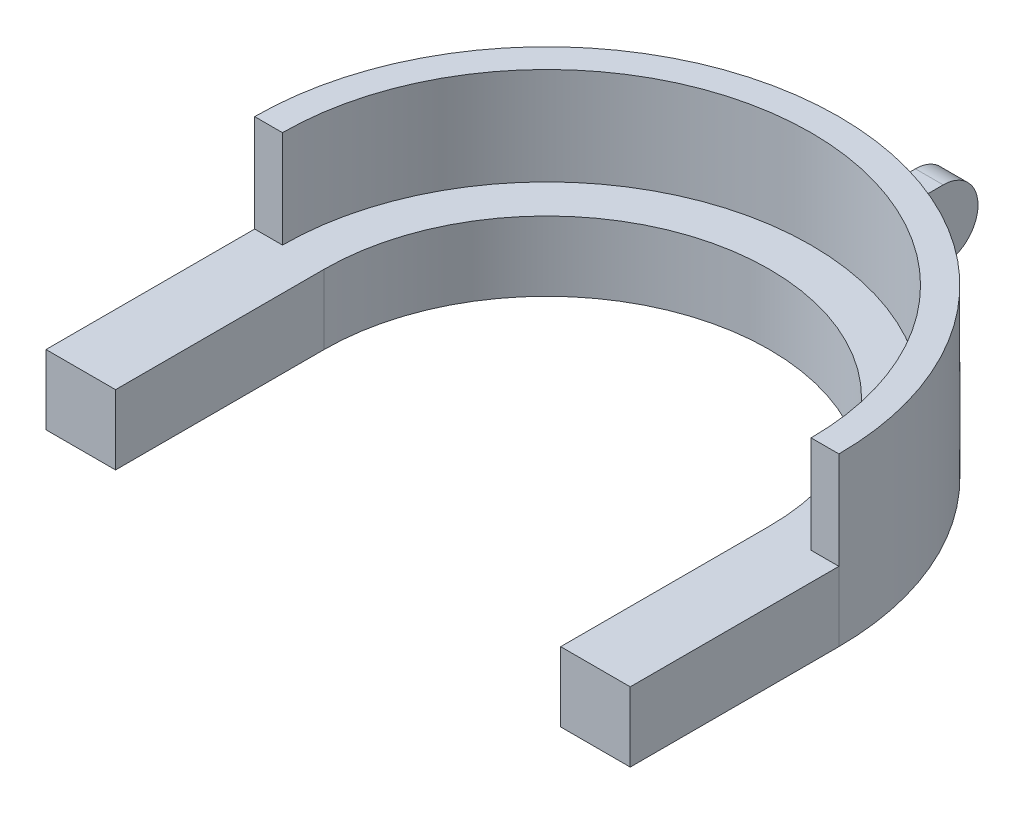
ISO-10303-21;
HEADER;
FILE_DESCRIPTION(('STEP AP214'),'2;1');
FILE_NAME('part.step','',(''),(''),'','','');
FILE_SCHEMA(('AUTOMOTIVE_DESIGN { 1 0 10303 214 1 1 1 1 }'));
ENDSEC;
DATA;
#1=APPLICATION_CONTEXT('core data for automotive mechanical design processes');
#2=APPLICATION_PROTOCOL_DEFINITION('international standard','automotive_design',2000,#1);
#3=PRODUCT_CONTEXT('',#1,'mechanical');
#4=PRODUCT('Part','Part','',(#3));
#5=PRODUCT_RELATED_PRODUCT_CATEGORY('part','',(#4));
#6=PRODUCT_DEFINITION_FORMATION('','',#4);
#7=PRODUCT_DEFINITION_CONTEXT('part definition',#1,'design');
#8=PRODUCT_DEFINITION('design','',#6,#7);
#9=PRODUCT_DEFINITION_SHAPE('','',#8);
#10=(LENGTH_UNIT() NAMED_UNIT(*) SI_UNIT(.MILLI.,.METRE.));
#11=(NAMED_UNIT(*) PLANE_ANGLE_UNIT() SI_UNIT($,.RADIAN.));
#12=(NAMED_UNIT(*) SI_UNIT($,.STERADIAN.) SOLID_ANGLE_UNIT());
#13=UNCERTAINTY_MEASURE_WITH_UNIT(LENGTH_MEASURE(1.E-05),#10,'distance_accuracy_value','');
#14=(GEOMETRIC_REPRESENTATION_CONTEXT(3) GLOBAL_UNCERTAINTY_ASSIGNED_CONTEXT((#13)) GLOBAL_UNIT_ASSIGNED_CONTEXT((#10,
#11,#12)) REPRESENTATION_CONTEXT('',''));
#15=CARTESIAN_POINT('',(0.,0.,0.));
#16=DIRECTION('',(0.,0.,1.));
#17=DIRECTION('',(1.,0.,0.));
#18=AXIS2_PLACEMENT_3D('',#15,#16,#17);
#19=CARTESIAN_POINT('',(0.,24.,0.));
#20=DIRECTION('',(0.,-1.,0.));
#21=DIRECTION('',(0.,0.,-1.));
#22=AXIS2_PLACEMENT_3D('',#19,#20,#21);
#23=CYLINDRICAL_SURFACE('',#22,42.);
#24=CARTESIAN_POINT('',(0.,0.,0.));
#25=DIRECTION('',(0.,-1.,0.));
#26=DIRECTION('',(0.,0.,-1.));
#27=AXIS2_PLACEMENT_3D('',#24,#25,#26);
#28=CIRCLE('',#27,42.);
#29=CARTESIAN_POINT('',(2.00000000000001,0.,-41.9523539268061));
#30=VERTEX_POINT('',#29);
#31=CARTESIAN_POINT('',(42.,0.,0.));
#32=VERTEX_POINT('',#31);
#33=EDGE_CURVE('E214',#30,#32,#28,.T.);
#34=ORIENTED_EDGE('',*,*,#33,.F.);
#35=DIRECTION('',(0.,-1.,0.));
#36=VECTOR('',#35,1.);
#37=CARTESIAN_POINT('',(2.00000000000001,24.,-41.9523539268061));
#38=LINE('',#37,#36);
#39=CARTESIAN_POINT('',(2.00000000000001,10.,-41.9523539268061));
#40=VERTEX_POINT('',#39);
#41=EDGE_CURVE('E46',#30,#40,#38,.F.);
#42=ORIENTED_EDGE('',*,*,#41,.T.);
#43=CARTESIAN_POINT('',(0.,10.,0.));
#44=DIRECTION('',(0.,1.,0.));
#45=DIRECTION('',(0.,0.,1.));
#46=AXIS2_PLACEMENT_3D('',#43,#44,#45);
#47=CIRCLE('',#46,42.);
#48=CARTESIAN_POINT('',(-1.99999999999999,10.,-41.9523539268061));
#49=VERTEX_POINT('',#48);
#50=EDGE_CURVE('E257',#49,#40,#47,.F.);
#51=ORIENTED_EDGE('',*,*,#50,.F.);
#52=DIRECTION('',(0.,-1.,0.));
#53=VECTOR('',#52,1.);
#54=CARTESIAN_POINT('',(-1.99999999999999,24.,-41.9523539268061));
#55=LINE('',#54,#53);
#56=CARTESIAN_POINT('',(-1.99999999999999,0.,-41.9523539268061));
#57=VERTEX_POINT('',#56);
#58=EDGE_CURVE('E259',#57,#49,#55,.F.);
#59=ORIENTED_EDGE('',*,*,#58,.F.);
#60=CARTESIAN_POINT('',(-42.,0.,0.));
#61=VERTEX_POINT('',#60);
#62=EDGE_CURVE('E159',#61,#57,#28,.T.);
#63=ORIENTED_EDGE('',*,*,#62,.F.);
#64=DIRECTION('',(0.,-1.,0.));
#65=VECTOR('',#64,1.);
#66=CARTESIAN_POINT('',(-42.,10.,0.));
#67=LINE('',#66,#65);
#68=CARTESIAN_POINT('',(-42.,10.,0.));
#69=VERTEX_POINT('',#68);
#70=EDGE_CURVE('E215',#69,#61,#67,.T.);
#71=ORIENTED_EDGE('',*,*,#70,.F.);
#72=DIRECTION('',(0.,-1.,0.));
#73=VECTOR('',#72,1.);
#74=CARTESIAN_POINT('',(-42.,24.,0.));
#75=LINE('',#74,#73);
#76=CARTESIAN_POINT('',(-42.,24.,0.));
#77=VERTEX_POINT('',#76);
#78=EDGE_CURVE('E241',#77,#69,#75,.T.);
#79=ORIENTED_EDGE('',*,*,#78,.F.);
#80=CARTESIAN_POINT('',(0.,24.,0.));
#81=DIRECTION('',(0.,-1.,0.));
#82=DIRECTION('',(0.,0.,-1.));
#83=AXIS2_PLACEMENT_3D('',#80,#81,#82);
#84=CIRCLE('',#83,42.);
#85=CARTESIAN_POINT('',(42.,24.,0.));
#86=VERTEX_POINT('',#85);
#87=EDGE_CURVE('E226',#77,#86,#84,.T.);
#88=ORIENTED_EDGE('',*,*,#87,.T.);
#89=DIRECTION('',(0.,-1.,0.));
#90=VECTOR('',#89,1.);
#91=CARTESIAN_POINT('',(42.,24.,0.));
#92=LINE('',#91,#90);
#93=CARTESIAN_POINT('',(42.,10.,0.));
#94=VERTEX_POINT('',#93);
#95=EDGE_CURVE('E238',#86,#94,#92,.T.);
#96=ORIENTED_EDGE('',*,*,#95,.T.);
#97=DIRECTION('',(0.,-1.,0.));
#98=VECTOR('',#97,1.);
#99=CARTESIAN_POINT('',(42.,10.,0.));
#100=LINE('',#99,#98);
#101=EDGE_CURVE('E173',#94,#32,#100,.T.);
#102=ORIENTED_EDGE('',*,*,#101,.T.);
#103=EDGE_LOOP('',(#34,#42,#51,#59,#63,#71,#79,#88,#96,#102));
#104=FACE_BOUND('',#103,.T.);
#105=ADVANCED_FACE('F38',(#104),#23,.T.);
#106=CARTESIAN_POINT('',(32.,10.,0.));
#107=DIRECTION('',(0.,0.,-1.));
#108=DIRECTION('',(-1.,0.,0.));
#109=AXIS2_PLACEMENT_3D('',#106,#107,#108);
#110=PLANE('',#109);
#111=DIRECTION('',(-1.,0.,0.));
#112=VECTOR('',#111,1.);
#113=CARTESIAN_POINT('',(0.,10.,0.));
#114=LINE('',#113,#112);
#115=CARTESIAN_POINT('',(38.,10.,0.));
#116=VERTEX_POINT('',#115);
#117=EDGE_CURVE('E189',#94,#116,#114,.T.);
#118=ORIENTED_EDGE('',*,*,#117,.F.);
#119=ORIENTED_EDGE('',*,*,#95,.F.);
#120=DIRECTION('',(-1.,0.,0.));
#121=VECTOR('',#120,1.);
#122=CARTESIAN_POINT('',(38.,24.,0.));
#123=LINE('',#122,#121);
#124=CARTESIAN_POINT('',(38.,24.,0.));
#125=VERTEX_POINT('',#124);
#126=EDGE_CURVE('E229',#86,#125,#123,.T.);
#127=ORIENTED_EDGE('',*,*,#126,.T.);
#128=DIRECTION('',(0.,-1.,0.));
#129=VECTOR('',#128,1.);
#130=CARTESIAN_POINT('',(38.,24.,0.));
#131=LINE('',#130,#129);
#132=EDGE_CURVE('E234',#125,#116,#131,.T.);
#133=ORIENTED_EDGE('',*,*,#132,.T.);
#134=EDGE_LOOP('',(#118,#119,#127,#133));
#135=FACE_BOUND('',#134,.T.);
#136=ADVANCED_FACE('F279',(#135),#110,.F.);
#137=CARTESIAN_POINT('',(-38.,10.,0.));
#138=DIRECTION('',(0.,0.,-1.));
#139=DIRECTION('',(-1.,0.,0.));
#140=AXIS2_PLACEMENT_3D('',#137,#138,#139);
#141=PLANE('',#140);
#142=DIRECTION('',(-1.,0.,0.));
#143=VECTOR('',#142,1.);
#144=CARTESIAN_POINT('',(0.,10.,0.));
#145=LINE('',#144,#143);
#146=CARTESIAN_POINT('',(-38.,10.,0.));
#147=VERTEX_POINT('',#146);
#148=EDGE_CURVE('E199',#147,#69,#145,.T.);
#149=ORIENTED_EDGE('',*,*,#148,.F.);
#150=DIRECTION('',(0.,-1.,0.));
#151=VECTOR('',#150,1.);
#152=CARTESIAN_POINT('',(-38.,24.,-2.65352581752078E-13));
#153=LINE('',#152,#151);
#154=CARTESIAN_POINT('',(-38.,24.,-2.65352581752078E-13));
#155=VERTEX_POINT('',#154);
#156=EDGE_CURVE('E232',#155,#147,#153,.T.);
#157=ORIENTED_EDGE('',*,*,#156,.F.);
#158=DIRECTION('',(-1.,0.,0.));
#159=VECTOR('',#158,1.);
#160=CARTESIAN_POINT('',(-38.,24.,-2.65352581752078E-13));
#161=LINE('',#160,#159);
#162=EDGE_CURVE('E223',#155,#77,#161,.T.);
#163=ORIENTED_EDGE('',*,*,#162,.T.);
#164=ORIENTED_EDGE('',*,*,#78,.T.);
#165=EDGE_LOOP('',(#149,#157,#163,#164));
#166=FACE_BOUND('',#165,.T.);
#167=ADVANCED_FACE('F40',(#166),#141,.F.);
#168=CARTESIAN_POINT('',(0.,10.,0.));
#169=DIRECTION('',(0.,-1.,0.));
#170=DIRECTION('',(0.,0.,-1.));
#171=AXIS2_PLACEMENT_3D('',#168,#169,#170);
#172=CYLINDRICAL_SURFACE('',#171,32.);
#173=CARTESIAN_POINT('',(0.,0.,0.));
#174=DIRECTION('',(0.,-1.,0.));
#175=DIRECTION('',(0.,0.,1.));
#176=AXIS2_PLACEMENT_3D('',#173,#174,#175);
#177=CIRCLE('',#176,32.);
#178=CARTESIAN_POINT('',(-32.,0.,0.));
#179=VERTEX_POINT('',#178);
#180=CARTESIAN_POINT('',(32.,0.,0.));
#181=VERTEX_POINT('',#180);
#182=EDGE_CURVE('E237',#179,#181,#177,.T.);
#183=ORIENTED_EDGE('',*,*,#182,.T.);
#184=DIRECTION('',(0.,-1.,0.));
#185=VECTOR('',#184,1.);
#186=CARTESIAN_POINT('',(32.,10.,0.));
#187=LINE('',#186,#185);
#188=CARTESIAN_POINT('',(32.,10.,0.));
#189=VERTEX_POINT('',#188);
#190=EDGE_CURVE('E251',#189,#181,#187,.T.);
#191=ORIENTED_EDGE('',*,*,#190,.F.);
#192=CARTESIAN_POINT('',(0.,10.,0.));
#193=DIRECTION('',(0.,-1.,0.));
#194=DIRECTION('',(0.,0.,1.));
#195=AXIS2_PLACEMENT_3D('',#192,#193,#194);
#196=CIRCLE('',#195,32.);
#197=CARTESIAN_POINT('',(-32.,10.,0.));
#198=VERTEX_POINT('',#197);
#199=EDGE_CURVE('E248',#198,#189,#196,.T.);
#200=ORIENTED_EDGE('',*,*,#199,.F.);
#201=DIRECTION('',(0.,-1.,0.));
#202=VECTOR('',#201,1.);
#203=CARTESIAN_POINT('',(-32.,10.,0.));
#204=LINE('',#203,#202);
#205=EDGE_CURVE('E255',#198,#179,#204,.T.);
#206=ORIENTED_EDGE('',*,*,#205,.T.);
#207=EDGE_LOOP('',(#183,#191,#200,#206));
#208=FACE_BOUND('',#207,.T.);
#209=ADVANCED_FACE('F297',(#208),#172,.F.);
#210=CARTESIAN_POINT('',(0.,10.,0.));
#211=DIRECTION('',(0.,1.,0.));
#212=DIRECTION('',(0.,0.,1.));
#213=AXIS2_PLACEMENT_3D('',#210,#211,#212);
#214=PLANE('',#213);
#215=CARTESIAN_POINT('',(0.,10.,0.));
#216=DIRECTION('',(0.,1.,0.));
#217=DIRECTION('',(0.,0.,1.));
#218=AXIS2_PLACEMENT_3D('',#215,#216,#217);
#219=CIRCLE('',#218,38.);
#220=EDGE_CURVE('E246',#116,#147,#219,.T.);
#221=ORIENTED_EDGE('',*,*,#220,.T.);
#222=ORIENTED_EDGE('',*,*,#148,.T.);
#223=DIRECTION('',(0.,0.,1.));
#224=VECTOR('',#223,1.);
#225=CARTESIAN_POINT('',(-42.,10.,0.));
#226=LINE('',#225,#224);
#227=CARTESIAN_POINT('',(-42.,10.,30.));
#228=VERTEX_POINT('',#227);
#229=EDGE_CURVE('E196',#69,#228,#226,.T.);
#230=ORIENTED_EDGE('',*,*,#229,.T.);
#231=DIRECTION('',(1.,0.,0.));
#232=VECTOR('',#231,1.);
#233=CARTESIAN_POINT('',(0.,10.,30.));
#234=LINE('',#233,#232);
#235=CARTESIAN_POINT('',(-32.,10.,30.));
#236=VERTEX_POINT('',#235);
#237=EDGE_CURVE('E194',#228,#236,#234,.T.);
#238=ORIENTED_EDGE('',*,*,#237,.T.);
#239=DIRECTION('',(0.,0.,1.));
#240=VECTOR('',#239,1.);
#241=CARTESIAN_POINT('',(-32.,10.,0.));
#242=LINE('',#241,#240);
#243=EDGE_CURVE('E202',#198,#236,#242,.T.);
#244=ORIENTED_EDGE('',*,*,#243,.F.);
#245=ORIENTED_EDGE('',*,*,#199,.T.);
#246=DIRECTION('',(0.,0.,1.));
#247=VECTOR('',#246,1.);
#248=CARTESIAN_POINT('',(32.,10.,0.));
#249=LINE('',#248,#247);
#250=CARTESIAN_POINT('',(32.,10.,30.));
#251=VERTEX_POINT('',#250);
#252=EDGE_CURVE('E191',#189,#251,#249,.T.);
#253=ORIENTED_EDGE('',*,*,#252,.T.);
#254=DIRECTION('',(1.,0.,0.));
#255=VECTOR('',#254,1.);
#256=CARTESIAN_POINT('',(0.,10.,30.));
#257=LINE('',#256,#255);
#258=CARTESIAN_POINT('',(42.,10.,30.));
#259=VERTEX_POINT('',#258);
#260=EDGE_CURVE('E181',#251,#259,#257,.T.);
#261=ORIENTED_EDGE('',*,*,#260,.T.);
#262=DIRECTION('',(0.,0.,1.));
#263=VECTOR('',#262,1.);
#264=CARTESIAN_POINT('',(42.,10.,0.));
#265=LINE('',#264,#263);
#266=EDGE_CURVE('E172',#94,#259,#265,.T.);
#267=ORIENTED_EDGE('',*,*,#266,.F.);
#268=ORIENTED_EDGE('',*,*,#117,.T.);
#269=EDGE_LOOP('',(#221,#222,#230,#238,#244,#245,#253,#261,#267,#268));
#270=FACE_BOUND('',#269,.T.);
#271=ADVANCED_FACE('F294',(#270),#214,.T.);
#272=CARTESIAN_POINT('',(0.,0.,0.));
#273=DIRECTION('',(0.,1.,0.));
#274=DIRECTION('',(0.,0.,1.));
#275=AXIS2_PLACEMENT_3D('',#272,#273,#274);
#276=PLANE('',#275);
#277=DIRECTION('',(0.,0.,-1.));
#278=VECTOR('',#277,1.);
#279=CARTESIAN_POINT('',(-1.99999999999999,0.,-36.));
#280=LINE('',#279,#278);
#281=CARTESIAN_POINT('',(-1.99999999999999,0.,-55.));
#282=VERTEX_POINT('',#281);
#283=EDGE_CURVE('E151',#57,#282,#280,.T.);
#284=ORIENTED_EDGE('',*,*,#283,.T.);
#285=DIRECTION('',(-1.,0.,0.));
#286=VECTOR('',#285,1.);
#287=CARTESIAN_POINT('',(8.00000000000001,0.,-55.));
#288=LINE('',#287,#286);
#289=CARTESIAN_POINT('',(2.00000000000001,0.,-55.));
#290=VERTEX_POINT('',#289);
#291=EDGE_CURVE('E143',#290,#282,#288,.T.);
#292=ORIENTED_EDGE('',*,*,#291,.F.);
#293=DIRECTION('',(0.,0.,-1.));
#294=VECTOR('',#293,1.);
#295=CARTESIAN_POINT('',(2.00000000000001,0.,-36.));
#296=LINE('',#295,#294);
#297=EDGE_CURVE('E60',#30,#290,#296,.T.);
#298=ORIENTED_EDGE('',*,*,#297,.F.);
#299=ORIENTED_EDGE('',*,*,#33,.T.);
#300=DIRECTION('',(0.,0.,1.));
#301=VECTOR('',#300,1.);
#302=CARTESIAN_POINT('',(42.,0.,0.));
#303=LINE('',#302,#301);
#304=CARTESIAN_POINT('',(42.,0.,30.));
#305=VERTEX_POINT('',#304);
#306=EDGE_CURVE('E177',#32,#305,#303,.T.);
#307=ORIENTED_EDGE('',*,*,#306,.T.);
#308=DIRECTION('',(1.,0.,0.));
#309=VECTOR('',#308,1.);
#310=CARTESIAN_POINT('',(0.,0.,30.));
#311=LINE('',#310,#309);
#312=CARTESIAN_POINT('',(32.,0.,30.));
#313=VERTEX_POINT('',#312);
#314=EDGE_CURVE('E183',#313,#305,#311,.T.);
#315=ORIENTED_EDGE('',*,*,#314,.F.);
#316=DIRECTION('',(0.,0.,1.));
#317=VECTOR('',#316,1.);
#318=CARTESIAN_POINT('',(32.,0.,0.));
#319=LINE('',#318,#317);
#320=EDGE_CURVE('E180',#181,#313,#319,.T.);
#321=ORIENTED_EDGE('',*,*,#320,.F.);
#322=ORIENTED_EDGE('',*,*,#182,.F.);
#323=DIRECTION('',(0.,0.,1.));
#324=VECTOR('',#323,1.);
#325=CARTESIAN_POINT('',(-32.,0.,0.));
#326=LINE('',#325,#324);
#327=CARTESIAN_POINT('',(-32.,0.,30.));
#328=VERTEX_POINT('',#327);
#329=EDGE_CURVE('E197',#179,#328,#326,.T.);
#330=ORIENTED_EDGE('',*,*,#329,.T.);
#331=DIRECTION('',(1.,0.,0.));
#332=VECTOR('',#331,1.);
#333=CARTESIAN_POINT('',(0.,0.,30.));
#334=LINE('',#333,#332);
#335=CARTESIAN_POINT('',(-42.,0.,30.));
#336=VERTEX_POINT('',#335);
#337=EDGE_CURVE('E186',#336,#328,#334,.T.);
#338=ORIENTED_EDGE('',*,*,#337,.F.);
#339=DIRECTION('',(0.,0.,1.));
#340=VECTOR('',#339,1.);
#341=CARTESIAN_POINT('',(-42.,0.,0.));
#342=LINE('',#341,#340);
#343=EDGE_CURVE('E208',#61,#336,#342,.T.);
#344=ORIENTED_EDGE('',*,*,#343,.F.);
#345=ORIENTED_EDGE('',*,*,#62,.T.);
#346=EDGE_LOOP('',(#284,#292,#298,#299,#307,#315,#321,#322,#330,#338,#344,#345));
#347=FACE_BOUND('',#346,.T.);
#348=ADVANCED_FACE('F157',(#347),#276,.F.);
#349=CARTESIAN_POINT('',(0.,24.,0.));
#350=DIRECTION('',(0.,-1.,0.));
#351=DIRECTION('',(0.,0.,-1.));
#352=AXIS2_PLACEMENT_3D('',#349,#350,#351);
#353=CYLINDRICAL_SURFACE('',#352,38.);
#354=ORIENTED_EDGE('',*,*,#156,.T.);
#355=ORIENTED_EDGE('',*,*,#220,.F.);
#356=ORIENTED_EDGE('',*,*,#132,.F.);
#357=CARTESIAN_POINT('',(0.,24.,0.));
#358=DIRECTION('',(0.,1.,0.));
#359=DIRECTION('',(0.,0.,-1.));
#360=AXIS2_PLACEMENT_3D('',#357,#358,#359);
#361=CIRCLE('',#360,38.);
#362=EDGE_CURVE('E220',#125,#155,#361,.T.);
#363=ORIENTED_EDGE('',*,*,#362,.T.);
#364=EDGE_LOOP('',(#354,#355,#356,#363));
#365=FACE_BOUND('',#364,.T.);
#366=ADVANCED_FACE('F290',(#365),#353,.F.);
#367=CARTESIAN_POINT('',(0.,24.,0.));
#368=DIRECTION('',(0.,-1.,0.));
#369=DIRECTION('',(0.,0.,-1.));
#370=AXIS2_PLACEMENT_3D('',#367,#368,#369);
#371=PLANE('',#370);
#372=ORIENTED_EDGE('',*,*,#362,.F.);
#373=ORIENTED_EDGE('',*,*,#126,.F.);
#374=ORIENTED_EDGE('',*,*,#87,.F.);
#375=ORIENTED_EDGE('',*,*,#162,.F.);
#376=EDGE_LOOP('',(#372,#373,#374,#375));
#377=FACE_BOUND('',#376,.T.);
#378=ADVANCED_FACE('F288',(#377),#371,.F.);
#379=CARTESIAN_POINT('',(0.,10.,30.));
#380=DIRECTION('',(0.,0.,-1.));
#381=DIRECTION('',(-1.,0.,0.));
#382=AXIS2_PLACEMENT_3D('',#379,#380,#381);
#383=PLANE('',#382);
#384=ORIENTED_EDGE('',*,*,#337,.T.);
#385=DIRECTION('',(0.,-1.,0.));
#386=VECTOR('',#385,1.);
#387=CARTESIAN_POINT('',(-32.,10.,30.));
#388=LINE('',#387,#386);
#389=EDGE_CURVE('E212',#236,#328,#388,.T.);
#390=ORIENTED_EDGE('',*,*,#389,.F.);
#391=ORIENTED_EDGE('',*,*,#237,.F.);
#392=DIRECTION('',(0.,-1.,0.));
#393=VECTOR('',#392,1.);
#394=CARTESIAN_POINT('',(-42.,10.,30.));
#395=LINE('',#394,#393);
#396=EDGE_CURVE('E205',#228,#336,#395,.T.);
#397=ORIENTED_EDGE('',*,*,#396,.T.);
#398=EDGE_LOOP('',(#384,#390,#391,#397));
#399=FACE_BOUND('',#398,.T.);
#400=ADVANCED_FACE('F319',(#399),#383,.F.);
#401=CARTESIAN_POINT('',(-32.,10.,0.));
#402=DIRECTION('',(1.,0.,0.));
#403=DIRECTION('',(0.,0.,-1.));
#404=AXIS2_PLACEMENT_3D('',#401,#402,#403);
#405=PLANE('',#404);
#406=ORIENTED_EDGE('',*,*,#329,.F.);
#407=ORIENTED_EDGE('',*,*,#205,.F.);
#408=ORIENTED_EDGE('',*,*,#243,.T.);
#409=ORIENTED_EDGE('',*,*,#389,.T.);
#410=EDGE_LOOP('',(#406,#407,#408,#409));
#411=FACE_BOUND('',#410,.T.);
#412=ADVANCED_FACE('F314',(#411),#405,.T.);
#413=CARTESIAN_POINT('',(-42.,10.,0.));
#414=DIRECTION('',(1.,0.,0.));
#415=DIRECTION('',(0.,0.,-1.));
#416=AXIS2_PLACEMENT_3D('',#413,#414,#415);
#417=PLANE('',#416);
#418=ORIENTED_EDGE('',*,*,#343,.T.);
#419=ORIENTED_EDGE('',*,*,#396,.F.);
#420=ORIENTED_EDGE('',*,*,#229,.F.);
#421=ORIENTED_EDGE('',*,*,#70,.T.);
#422=EDGE_LOOP('',(#418,#419,#420,#421));
#423=FACE_BOUND('',#422,.T.);
#424=ADVANCED_FACE('F322',(#423),#417,.F.);
#425=CARTESIAN_POINT('',(0.,10.,30.));
#426=DIRECTION('',(0.,0.,-1.));
#427=DIRECTION('',(-1.,0.,0.));
#428=AXIS2_PLACEMENT_3D('',#425,#426,#427);
#429=PLANE('',#428);
#430=ORIENTED_EDGE('',*,*,#314,.T.);
#431=DIRECTION('',(0.,-1.,0.));
#432=VECTOR('',#431,1.);
#433=CARTESIAN_POINT('',(42.,10.,30.));
#434=LINE('',#433,#432);
#435=EDGE_CURVE('E162',#259,#305,#434,.T.);
#436=ORIENTED_EDGE('',*,*,#435,.F.);
#437=ORIENTED_EDGE('',*,*,#260,.F.);
#438=DIRECTION('',(0.,-1.,0.));
#439=VECTOR('',#438,1.);
#440=CARTESIAN_POINT('',(32.,10.,30.));
#441=LINE('',#440,#439);
#442=EDGE_CURVE('E169',#251,#313,#441,.T.);
#443=ORIENTED_EDGE('',*,*,#442,.T.);
#444=EDGE_LOOP('',(#430,#436,#437,#443));
#445=FACE_BOUND('',#444,.T.);
#446=ADVANCED_FACE('F340',(#445),#429,.F.);
#447=CARTESIAN_POINT('',(42.,10.,0.));
#448=DIRECTION('',(1.,0.,0.));
#449=DIRECTION('',(0.,0.,-1.));
#450=AXIS2_PLACEMENT_3D('',#447,#448,#449);
#451=PLANE('',#450);
#452=ORIENTED_EDGE('',*,*,#306,.F.);
#453=ORIENTED_EDGE('',*,*,#101,.F.);
#454=ORIENTED_EDGE('',*,*,#266,.T.);
#455=ORIENTED_EDGE('',*,*,#435,.T.);
#456=EDGE_LOOP('',(#452,#453,#454,#455));
#457=FACE_BOUND('',#456,.T.);
#458=ADVANCED_FACE('F335',(#457),#451,.T.);
#459=CARTESIAN_POINT('',(32.,10.,0.));
#460=DIRECTION('',(1.,0.,0.));
#461=DIRECTION('',(0.,0.,-1.));
#462=AXIS2_PLACEMENT_3D('',#459,#460,#461);
#463=PLANE('',#462);
#464=ORIENTED_EDGE('',*,*,#320,.T.);
#465=ORIENTED_EDGE('',*,*,#442,.F.);
#466=ORIENTED_EDGE('',*,*,#252,.F.);
#467=ORIENTED_EDGE('',*,*,#190,.T.);
#468=EDGE_LOOP('',(#464,#465,#466,#467));
#469=FACE_BOUND('',#468,.T.);
#470=ADVANCED_FACE('F342',(#469),#463,.F.);
#471=CARTESIAN_POINT('',(2.00000000000001,10.,-36.));
#472=DIRECTION('',(-1.,0.,0.));
#473=DIRECTION('',(0.,0.,1.));
#474=AXIS2_PLACEMENT_3D('',#471,#472,#473);
#475=PLANE('',#474);
#476=ORIENTED_EDGE('',*,*,#297,.T.);
#477=CARTESIAN_POINT('',(2.00000000000001,5.,-55.));
#478=DIRECTION('',(-1.,0.,0.));
#479=DIRECTION('',(0.,0.,1.));
#480=AXIS2_PLACEMENT_3D('',#477,#478,#479);
#481=CIRCLE('',#480,5.);
#482=CARTESIAN_POINT('',(2.00000000000001,10.,-55.));
#483=VERTEX_POINT('',#482);
#484=EDGE_CURVE('E145',#290,#483,#481,.F.);
#485=ORIENTED_EDGE('',*,*,#484,.T.);
#486=DIRECTION('',(0.,0.,-1.));
#487=VECTOR('',#486,1.);
#488=CARTESIAN_POINT('',(2.00000000000001,10.,-36.));
#489=LINE('',#488,#487);
#490=EDGE_CURVE('E160',#40,#483,#489,.T.);
#491=ORIENTED_EDGE('',*,*,#490,.F.);
#492=ORIENTED_EDGE('',*,*,#41,.F.);
#493=EDGE_LOOP('',(#476,#485,#491,#492));
#494=FACE_BOUND('',#493,.T.);
#495=ADVANCED_FACE('F266',(#494),#475,.F.);
#496=CARTESIAN_POINT('',(-1.99999999999999,10.,-36.));
#497=DIRECTION('',(-1.,0.,0.));
#498=DIRECTION('',(0.,0.,1.));
#499=AXIS2_PLACEMENT_3D('',#496,#497,#498);
#500=PLANE('',#499);
#501=CARTESIAN_POINT('',(-1.99999999999999,5.,-55.));
#502=DIRECTION('',(1.,0.,0.));
#503=DIRECTION('',(0.,0.,1.));
#504=AXIS2_PLACEMENT_3D('',#501,#502,#503);
#505=CIRCLE('',#504,5.);
#506=CARTESIAN_POINT('',(-1.99999999999999,10.,-55.));
#507=VERTEX_POINT('',#506);
#508=EDGE_CURVE('E52',#282,#507,#505,.T.);
#509=ORIENTED_EDGE('',*,*,#508,.F.);
#510=ORIENTED_EDGE('',*,*,#283,.F.);
#511=ORIENTED_EDGE('',*,*,#58,.T.);
#512=DIRECTION('',(0.,0.,-1.));
#513=VECTOR('',#512,1.);
#514=CARTESIAN_POINT('',(-1.99999999999999,10.,-36.));
#515=LINE('',#514,#513);
#516=EDGE_CURVE('E154',#49,#507,#515,.T.);
#517=ORIENTED_EDGE('',*,*,#516,.T.);
#518=EDGE_LOOP('',(#509,#510,#511,#517));
#519=FACE_BOUND('',#518,.T.);
#520=ADVANCED_FACE('F150',(#519),#500,.T.);
#521=CARTESIAN_POINT('',(0.,10.,0.));
#522=DIRECTION('',(0.,1.,0.));
#523=DIRECTION('',(0.,0.,1.));
#524=AXIS2_PLACEMENT_3D('',#521,#522,#523);
#525=PLANE('',#524);
#526=DIRECTION('',(-1.,0.,0.));
#527=VECTOR('',#526,1.);
#528=CARTESIAN_POINT('',(8.00000000000001,10.,-55.));
#529=LINE('',#528,#527);
#530=EDGE_CURVE('E11',#507,#483,#529,.F.);
#531=ORIENTED_EDGE('',*,*,#530,.F.);
#532=ORIENTED_EDGE('',*,*,#516,.F.);
#533=ORIENTED_EDGE('',*,*,#50,.T.);
#534=ORIENTED_EDGE('',*,*,#490,.T.);
#535=EDGE_LOOP('',(#531,#532,#533,#534));
#536=FACE_BOUND('',#535,.T.);
#537=ADVANCED_FACE('F268',(#536),#525,.T.);
#538=CARTESIAN_POINT('',(8.00000000000001,5.,-55.));
#539=DIRECTION('',(-1.,0.,0.));
#540=DIRECTION('',(0.,0.,1.));
#541=AXIS2_PLACEMENT_3D('',#538,#539,#540);
#542=CYLINDRICAL_SURFACE('',#541,5.);
#543=ORIENTED_EDGE('',*,*,#291,.T.);
#544=ORIENTED_EDGE('',*,*,#508,.T.);
#545=ORIENTED_EDGE('',*,*,#530,.T.);
#546=ORIENTED_EDGE('',*,*,#484,.F.);
#547=EDGE_LOOP('',(#543,#544,#545,#546));
#548=FACE_BOUND('',#547,.T.);
#549=ADVANCED_FACE('F144',(#548),#542,.T.);
#550=CLOSED_SHELL('',(#105,#136,#167,#209,#271,#348,#366,#378,#400,#412,#424,#446,#458,#470,
#495,#520,#537,#549));
#551=MANIFOLD_SOLID_BREP('B2',#550);
#552=ADVANCED_BREP_SHAPE_REPRESENTATION('',(#18,#551),#14);
#553=SHAPE_DEFINITION_REPRESENTATION(#9,#552);
ENDSEC;
END-ISO-10303-21;
